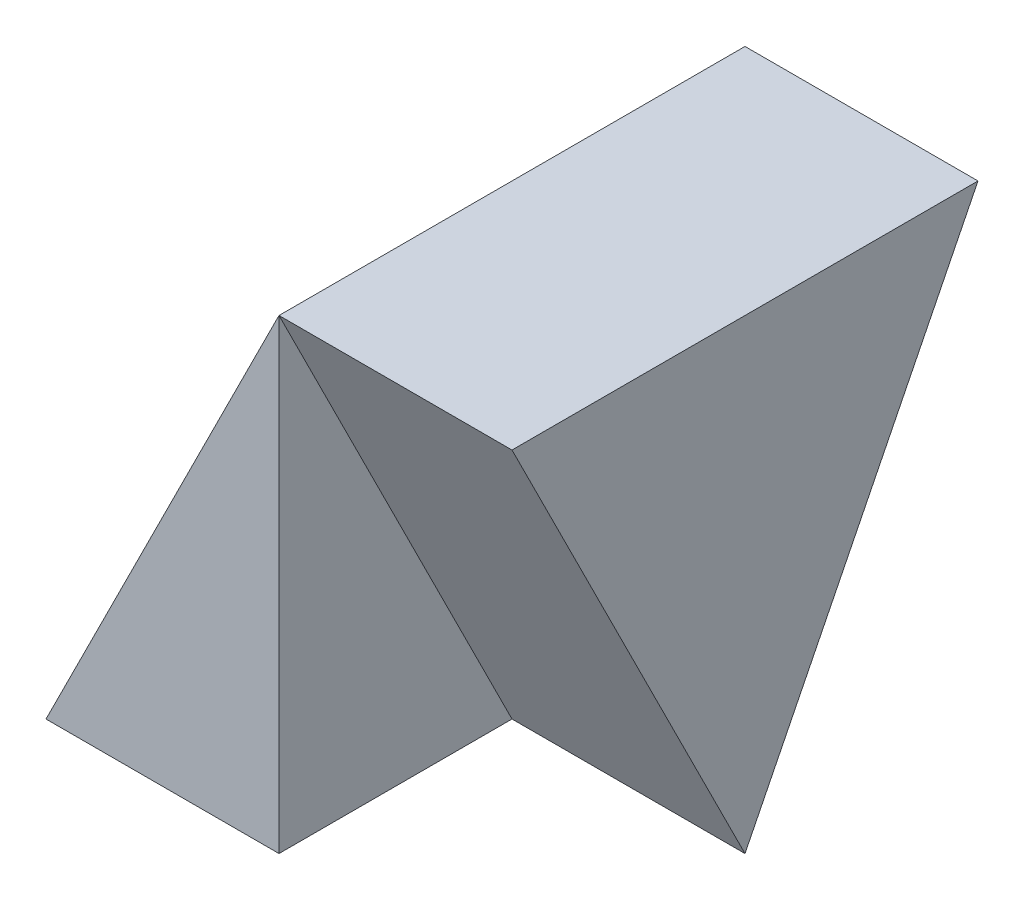
ISO-10303-21;
HEADER;
FILE_DESCRIPTION(('STEP AP214'),'2;1');
FILE_NAME('part.step','',(''),(''),'','','');
FILE_SCHEMA(('AUTOMOTIVE_DESIGN { 1 0 10303 214 1 1 1 1 }'));
ENDSEC;
DATA;
#1=APPLICATION_CONTEXT('core data for automotive mechanical design processes');
#2=APPLICATION_PROTOCOL_DEFINITION('international standard','automotive_design',2000,#1);
#3=PRODUCT_CONTEXT('',#1,'mechanical');
#4=PRODUCT('Part','Part','',(#3));
#5=PRODUCT_RELATED_PRODUCT_CATEGORY('part','',(#4));
#6=PRODUCT_DEFINITION_FORMATION('','',#4);
#7=PRODUCT_DEFINITION_CONTEXT('part definition',#1,'design');
#8=PRODUCT_DEFINITION('design','',#6,#7);
#9=PRODUCT_DEFINITION_SHAPE('','',#8);
#10=(LENGTH_UNIT() NAMED_UNIT(*) SI_UNIT(.MILLI.,.METRE.));
#11=(NAMED_UNIT(*) PLANE_ANGLE_UNIT() SI_UNIT($,.RADIAN.));
#12=(NAMED_UNIT(*) SI_UNIT($,.STERADIAN.) SOLID_ANGLE_UNIT());
#13=UNCERTAINTY_MEASURE_WITH_UNIT(LENGTH_MEASURE(1.E-05),#10,'distance_accuracy_value','');
#14=(GEOMETRIC_REPRESENTATION_CONTEXT(3) GLOBAL_UNCERTAINTY_ASSIGNED_CONTEXT((#13)) GLOBAL_UNIT_ASSIGNED_CONTEXT((#10,
#11,#12)) REPRESENTATION_CONTEXT('',''));
#15=CARTESIAN_POINT('',(0.,0.,0.));
#16=DIRECTION('',(0.,0.,1.));
#17=DIRECTION('',(1.,0.,0.));
#18=AXIS2_PLACEMENT_3D('',#15,#16,#17);
#19=CARTESIAN_POINT('',(0.,0.,40.));
#20=DIRECTION('',(0.,1.,0.));
#21=DIRECTION('',(0.,0.,1.));
#22=AXIS2_PLACEMENT_3D('',#19,#20,#21);
#23=PLANE('',#22);
#24=DIRECTION('',(0.,0.,-1.));
#25=VECTOR('',#24,1.);
#26=CARTESIAN_POINT('',(20.,0.,0.));
#27=LINE('',#26,#25);
#28=CARTESIAN_POINT('',(20.,0.,20.));
#29=VERTEX_POINT('',#28);
#30=CARTESIAN_POINT('',(20.,0.,0.));
#31=VERTEX_POINT('',#30);
#32=EDGE_CURVE('E90',#29,#31,#27,.T.);
#33=ORIENTED_EDGE('',*,*,#32,.F.);
#34=DIRECTION('',(0.,0.,-1.));
#35=VECTOR('',#34,1.);
#36=CARTESIAN_POINT('',(20.,0.,0.));
#37=LINE('',#36,#35);
#38=CARTESIAN_POINT('',(20.,0.,40.));
#39=VERTEX_POINT('',#38);
#40=EDGE_CURVE('E131',#39,#29,#37,.T.);
#41=ORIENTED_EDGE('',*,*,#40,.F.);
#42=DIRECTION('',(1.,0.,0.));
#43=VECTOR('',#42,1.);
#44=CARTESIAN_POINT('',(0.,0.,40.));
#45=LINE('',#44,#43);
#46=CARTESIAN_POINT('',(0.,0.,40.));
#47=VERTEX_POINT('',#46);
#48=EDGE_CURVE('E106',#47,#39,#45,.T.);
#49=ORIENTED_EDGE('',*,*,#48,.F.);
#50=DIRECTION('',(0.,0.,-1.));
#51=VECTOR('',#50,1.);
#52=CARTESIAN_POINT('',(0.,0.,40.));
#53=LINE('',#52,#51);
#54=CARTESIAN_POINT('',(0.,0.,0.));
#55=VERTEX_POINT('',#54);
#56=EDGE_CURVE('E11',#47,#55,#53,.T.);
#57=ORIENTED_EDGE('',*,*,#56,.T.);
#58=DIRECTION('',(1.,0.,0.));
#59=VECTOR('',#58,1.);
#60=CARTESIAN_POINT('',(0.,0.,0.));
#61=LINE('',#60,#59);
#62=EDGE_CURVE('E99',#55,#31,#61,.T.);
#63=ORIENTED_EDGE('',*,*,#62,.T.);
#64=EDGE_LOOP('',(#33,#41,#49,#57,#63));
#65=FACE_BOUND('',#64,.T.);
#66=ADVANCED_FACE('F33',(#65),#23,.F.);
#67=CARTESIAN_POINT('',(0.,0.,0.));
#68=DIRECTION('',(0.,0.,-1.));
#69=DIRECTION('',(-1.,0.,0.));
#70=AXIS2_PLACEMENT_3D('',#67,#68,#69);
#71=PLANE('',#70);
#72=DIRECTION('',(0.447213595499958,0.894427190999916,0.));
#73=VECTOR('',#72,1.);
#74=CARTESIAN_POINT('',(0.,0.,0.));
#75=LINE('',#74,#73);
#76=CARTESIAN_POINT('',(20.,40.,0.));
#77=VERTEX_POINT('',#76);
#78=EDGE_CURVE('E48',#55,#77,#75,.T.);
#79=ORIENTED_EDGE('',*,*,#78,.T.);
#80=DIRECTION('',(0.,1.,0.));
#81=VECTOR('',#80,1.);
#82=CARTESIAN_POINT('',(20.,0.,0.));
#83=LINE('',#82,#81);
#84=EDGE_CURVE('E93',#31,#77,#83,.T.);
#85=ORIENTED_EDGE('',*,*,#84,.F.);
#86=ORIENTED_EDGE('',*,*,#62,.F.);
#87=EDGE_LOOP('',(#79,#85,#86));
#88=FACE_BOUND('',#87,.T.);
#89=ADVANCED_FACE('F98',(#88),#71,.T.);
#90=CARTESIAN_POINT('',(0.,0.,40.));
#91=DIRECTION('',(0.,0.,-1.));
#92=DIRECTION('',(-1.,0.,0.));
#93=AXIS2_PLACEMENT_3D('',#90,#91,#92);
#94=PLANE('',#93);
#95=DIRECTION('',(0.,-1.,0.));
#96=VECTOR('',#95,1.);
#97=CARTESIAN_POINT('',(20.,0.,40.));
#98=LINE('',#97,#96);
#99=CARTESIAN_POINT('',(20.,40.,40.));
#100=VERTEX_POINT('',#99);
#101=EDGE_CURVE('E63',#100,#39,#98,.T.);
#102=ORIENTED_EDGE('',*,*,#101,.F.);
#103=DIRECTION('',(0.447213595499958,0.894427190999916,0.));
#104=VECTOR('',#103,1.);
#105=CARTESIAN_POINT('',(0.,0.,40.));
#106=LINE('',#105,#104);
#107=EDGE_CURVE('E123',#47,#100,#106,.T.);
#108=ORIENTED_EDGE('',*,*,#107,.F.);
#109=ORIENTED_EDGE('',*,*,#48,.T.);
#110=EDGE_LOOP('',(#102,#108,#109));
#111=FACE_BOUND('',#110,.T.);
#112=ADVANCED_FACE('F142',(#111),#94,.F.);
#113=CARTESIAN_POINT('',(40.,0.,40.));
#114=DIRECTION('',(-1.,0.,0.));
#115=DIRECTION('',(0.,0.,1.));
#116=AXIS2_PLACEMENT_3D('',#113,#114,#115);
#117=PLANE('',#116);
#118=DIRECTION('',(0.,0.894427190999916,0.447213595499958));
#119=VECTOR('',#118,1.);
#120=CARTESIAN_POINT('',(40.,-8.,16.));
#121=LINE('',#120,#119);
#122=CARTESIAN_POINT('',(40.,0.,20.));
#123=VERTEX_POINT('',#122);
#124=CARTESIAN_POINT('',(40.,40.,40.));
#125=VERTEX_POINT('',#124);
#126=EDGE_CURVE('E128',#123,#125,#121,.T.);
#127=ORIENTED_EDGE('',*,*,#126,.F.);
#128=DIRECTION('',(0.,-0.894427190999916,0.447213595499958));
#129=VECTOR('',#128,1.);
#130=CARTESIAN_POINT('',(40.,8.,16.));
#131=LINE('',#130,#129);
#132=CARTESIAN_POINT('',(40.,40.,0.));
#133=VERTEX_POINT('',#132);
#134=EDGE_CURVE('E75',#133,#123,#131,.T.);
#135=ORIENTED_EDGE('',*,*,#134,.F.);
#136=DIRECTION('',(0.,0.,-1.));
#137=VECTOR('',#136,1.);
#138=CARTESIAN_POINT('',(40.,40.,40.));
#139=LINE('',#138,#137);
#140=EDGE_CURVE('E41',#125,#133,#139,.T.);
#141=ORIENTED_EDGE('',*,*,#140,.F.);
#142=EDGE_LOOP('',(#127,#135,#141));
#143=FACE_BOUND('',#142,.T.);
#144=ADVANCED_FACE('F139',(#143),#117,.F.);
#145=CARTESIAN_POINT('',(0.,40.,40.));
#146=DIRECTION('',(0.,-1.,0.));
#147=DIRECTION('',(0.,0.,-1.));
#148=AXIS2_PLACEMENT_3D('',#145,#146,#147);
#149=PLANE('',#148);
#150=DIRECTION('',(-1.,0.,0.));
#151=VECTOR('',#150,1.);
#152=CARTESIAN_POINT('',(0.,40.,0.));
#153=LINE('',#152,#151);
#154=EDGE_CURVE('E103',#133,#77,#153,.T.);
#155=ORIENTED_EDGE('',*,*,#154,.T.);
#156=DIRECTION('',(0.,0.,1.));
#157=VECTOR('',#156,1.);
#158=CARTESIAN_POINT('',(20.,40.,0.));
#159=LINE('',#158,#157);
#160=EDGE_CURVE('E104',#77,#100,#159,.T.);
#161=ORIENTED_EDGE('',*,*,#160,.T.);
#162=DIRECTION('',(-1.,0.,0.));
#163=VECTOR('',#162,1.);
#164=CARTESIAN_POINT('',(0.,40.,40.));
#165=LINE('',#164,#163);
#166=EDGE_CURVE('E111',#125,#100,#165,.T.);
#167=ORIENTED_EDGE('',*,*,#166,.F.);
#168=ORIENTED_EDGE('',*,*,#140,.T.);
#169=EDGE_LOOP('',(#155,#161,#167,#168));
#170=FACE_BOUND('',#169,.T.);
#171=ADVANCED_FACE('F140',(#170),#149,.F.);
#172=CARTESIAN_POINT('',(0.,0.,0.));
#173=DIRECTION('',(0.894427190999916,-0.447213595499958,0.));
#174=DIRECTION('',(0.447213595499958,0.894427190999916,0.));
#175=AXIS2_PLACEMENT_3D('',#172,#173,#174);
#176=PLANE('',#175);
#177=ORIENTED_EDGE('',*,*,#107,.T.);
#178=ORIENTED_EDGE('',*,*,#160,.F.);
#179=ORIENTED_EDGE('',*,*,#78,.F.);
#180=ORIENTED_EDGE('',*,*,#56,.F.);
#181=EDGE_LOOP('',(#177,#178,#179,#180));
#182=FACE_BOUND('',#181,.T.);
#183=ADVANCED_FACE('F141',(#182),#176,.F.);
#184=CARTESIAN_POINT('',(20.,-8.,16.));
#185=DIRECTION('',(0.,0.447213595499958,-0.894427190999916));
#186=DIRECTION('',(0.,0.894427190999916,0.447213595499958));
#187=AXIS2_PLACEMENT_3D('',#184,#185,#186);
#188=PLANE('',#187);
#189=ORIENTED_EDGE('',*,*,#126,.T.);
#190=ORIENTED_EDGE('',*,*,#166,.T.);
#191=DIRECTION('',(0.,0.894427190999916,0.447213595499958));
#192=VECTOR('',#191,1.);
#193=CARTESIAN_POINT('',(20.,-8.,16.));
#194=LINE('',#193,#192);
#195=EDGE_CURVE('E127',#29,#100,#194,.T.);
#196=ORIENTED_EDGE('',*,*,#195,.F.);
#197=DIRECTION('',(1.,0.,0.));
#198=VECTOR('',#197,1.);
#199=CARTESIAN_POINT('',(20.,0.,20.));
#200=LINE('',#199,#198);
#201=EDGE_CURVE('E83',#29,#123,#200,.T.);
#202=ORIENTED_EDGE('',*,*,#201,.T.);
#203=EDGE_LOOP('',(#189,#190,#196,#202));
#204=FACE_BOUND('',#203,.T.);
#205=ADVANCED_FACE('F136',(#204),#188,.F.);
#206=CARTESIAN_POINT('',(20.,0.,0.));
#207=DIRECTION('',(1.,0.,0.));
#208=DIRECTION('',(0.,0.,-1.));
#209=AXIS2_PLACEMENT_3D('',#206,#207,#208);
#210=PLANE('',#209);
#211=ORIENTED_EDGE('',*,*,#101,.T.);
#212=ORIENTED_EDGE('',*,*,#40,.T.);
#213=ORIENTED_EDGE('',*,*,#195,.T.);
#214=EDGE_LOOP('',(#211,#212,#213));
#215=FACE_BOUND('',#214,.T.);
#216=ADVANCED_FACE('F135',(#215),#210,.T.);
#217=CARTESIAN_POINT('',(20.,8.,16.));
#218=DIRECTION('',(0.,0.447213595499958,0.894427190999916));
#219=DIRECTION('',(0.,-0.894427190999916,0.447213595499958));
#220=AXIS2_PLACEMENT_3D('',#217,#218,#219);
#221=PLANE('',#220);
#222=ORIENTED_EDGE('',*,*,#134,.T.);
#223=ORIENTED_EDGE('',*,*,#201,.F.);
#224=DIRECTION('',(0.,-0.894427190999916,0.447213595499958));
#225=VECTOR('',#224,1.);
#226=CARTESIAN_POINT('',(20.,8.,16.));
#227=LINE('',#226,#225);
#228=EDGE_CURVE('E80',#77,#29,#227,.T.);
#229=ORIENTED_EDGE('',*,*,#228,.F.);
#230=ORIENTED_EDGE('',*,*,#154,.F.);
#231=EDGE_LOOP('',(#222,#223,#229,#230));
#232=FACE_BOUND('',#231,.T.);
#233=ADVANCED_FACE('F201',(#232),#221,.F.);
#234=CARTESIAN_POINT('',(20.,0.,0.));
#235=DIRECTION('',(1.,0.,0.));
#236=DIRECTION('',(0.,0.,-1.));
#237=AXIS2_PLACEMENT_3D('',#234,#235,#236);
#238=PLANE('',#237);
#239=ORIENTED_EDGE('',*,*,#84,.T.);
#240=ORIENTED_EDGE('',*,*,#228,.T.);
#241=ORIENTED_EDGE('',*,*,#32,.T.);
#242=EDGE_LOOP('',(#239,#240,#241));
#243=FACE_BOUND('',#242,.T.);
#244=ADVANCED_FACE('F92',(#243),#238,.T.);
#245=CLOSED_SHELL('',(#66,#89,#112,#144,#171,#183,#205,#216,#233,#244));
#246=MANIFOLD_SOLID_BREP('B2',#245);
#247=ADVANCED_BREP_SHAPE_REPRESENTATION('',(#18,#246),#14);
#248=SHAPE_DEFINITION_REPRESENTATION(#9,#247);
ENDSEC;
END-ISO-10303-21;
